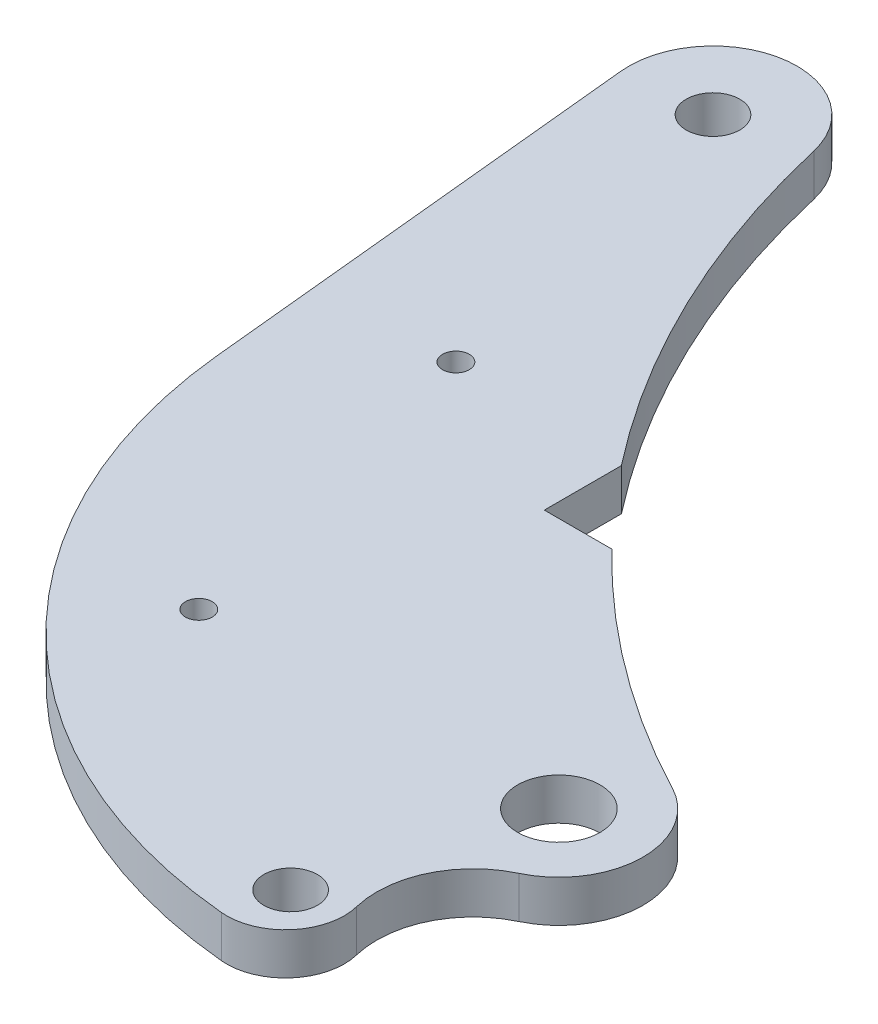
ISO-10303-21;
HEADER;
FILE_DESCRIPTION(('STEP AP214'),'2;1');
FILE_NAME('part.step','',(''),(''),'','','');
FILE_SCHEMA(('AUTOMOTIVE_DESIGN { 1 0 10303 214 1 1 1 1 }'));
ENDSEC;
DATA;
#1=APPLICATION_CONTEXT('core data for automotive mechanical design processes');
#2=APPLICATION_PROTOCOL_DEFINITION('international standard','automotive_design',2000,#1);
#3=PRODUCT_CONTEXT('',#1,'mechanical');
#4=PRODUCT('Part','Part','',(#3));
#5=PRODUCT_RELATED_PRODUCT_CATEGORY('part','',(#4));
#6=PRODUCT_DEFINITION_FORMATION('','',#4);
#7=PRODUCT_DEFINITION_CONTEXT('part definition',#1,'design');
#8=PRODUCT_DEFINITION('design','',#6,#7);
#9=PRODUCT_DEFINITION_SHAPE('','',#8);
#10=(LENGTH_UNIT() NAMED_UNIT(*) SI_UNIT(.MILLI.,.METRE.));
#11=(NAMED_UNIT(*) PLANE_ANGLE_UNIT() SI_UNIT($,.RADIAN.));
#12=(NAMED_UNIT(*) SI_UNIT($,.STERADIAN.) SOLID_ANGLE_UNIT());
#13=UNCERTAINTY_MEASURE_WITH_UNIT(LENGTH_MEASURE(1.E-05),#10,'distance_accuracy_value','');
#14=(GEOMETRIC_REPRESENTATION_CONTEXT(3) GLOBAL_UNCERTAINTY_ASSIGNED_CONTEXT((#13)) GLOBAL_UNIT_ASSIGNED_CONTEXT((#10,
#11,#12)) REPRESENTATION_CONTEXT('',''));
#15=CARTESIAN_POINT('',(0.,0.,0.));
#16=DIRECTION('',(0.,0.,1.));
#17=DIRECTION('',(1.,0.,0.));
#18=AXIS2_PLACEMENT_3D('',#15,#16,#17);
#19=CARTESIAN_POINT('',(0.,2.4765,0.));
#20=DIRECTION('',(0.,1.,0.));
#21=DIRECTION('',(0.,0.,1.));
#22=AXIS2_PLACEMENT_3D('',#19,#20,#21);
#23=PLANE('',#22);
#24=CARTESIAN_POINT('',(10.16,2.4765,40.64));
#25=DIRECTION('',(0.,1.,0.));
#26=DIRECTION('',(0.,0.,1.));
#27=AXIS2_PLACEMENT_3D('',#24,#25,#26);
#28=CIRCLE('',#27,1.5875);
#29=CARTESIAN_POINT('',(10.16,2.4765,42.2275));
#30=VERTEX_POINT('',#29);
#31=EDGE_CURVE('E234',#30,#30,#28,.T.);
#32=ORIENTED_EDGE('',*,*,#31,.F.);
#33=EDGE_LOOP('',(#32));
#34=FACE_BOUND('',#33,.T.);
#35=CARTESIAN_POINT('',(62.1230111231787,2.4765,80.394598630688));
#36=DIRECTION('',(0.,1.,0.));
#37=DIRECTION('',(0.,0.,1.));
#38=AXIS2_PLACEMENT_3D('',#35,#36,#37);
#39=CIRCLE('',#38,4.88950000000001);
#40=CARTESIAN_POINT('',(62.1230111231787,2.4765,85.2840986306881));
#41=VERTEX_POINT('',#40);
#42=EDGE_CURVE('E222',#41,#41,#39,.T.);
#43=ORIENTED_EDGE('',*,*,#42,.F.);
#44=EDGE_LOOP('',(#43));
#45=FACE_BOUND('',#44,.T.);
#46=CARTESIAN_POINT('',(0.,2.4765,0.));
#47=DIRECTION('',(0.,1.,0.));
#48=DIRECTION('',(0.,0.,1.));
#49=AXIS2_PLACEMENT_3D('',#46,#47,#48);
#50=CIRCLE('',#49,9.9695);
#51=CARTESIAN_POINT('',(9.71285470277228,2.4765,-2.24752836975072));
#52=VERTEX_POINT('',#51);
#53=CARTESIAN_POINT('',(-9.92069398107694,2.4765,0.985272136936646));
#54=VERTEX_POINT('',#53);
#55=EDGE_CURVE('E171',#52,#54,#50,.T.);
#56=ORIENTED_EDGE('',*,*,#55,.T.);
#57=DIRECTION('',(0.0988286410488635,0.,0.995104466731225));
#58=VECTOR('',#57,1.);
#59=CARTESIAN_POINT('',(-9.92069398107694,2.4765,0.985272136936646));
#60=LINE('',#59,#58);
#61=CARTESIAN_POINT('',(-4.64533862475767,2.4765,54.1027654359922));
#62=VERTEX_POINT('',#61);
#63=EDGE_CURVE('E109',#54,#62,#60,.T.);
#64=ORIENTED_EDGE('',*,*,#63,.T.);
#65=CARTESIAN_POINT('',(58.5437950126751,2.4765,47.8271467293893));
#66=DIRECTION('',(0.,1.,0.));
#67=DIRECTION('',(0.,0.,-1.));
#68=AXIS2_PLACEMENT_3D('',#65,#66,#67);
#69=CIRCLE('',#68,63.5);
#70=CARTESIAN_POINT('',(52.7819661923493,2.4765,111.06519958244));
#71=VERTEX_POINT('',#70);
#72=EDGE_CURVE('E192',#62,#71,#69,.T.);
#73=ORIENTED_EDGE('',*,*,#72,.T.);
#74=CARTESIAN_POINT('',(53.4157673625851,2.4765,104.109013768605));
#75=DIRECTION('',(0.,1.,0.));
#76=DIRECTION('',(0.,0.,1.));
#77=AXIS2_PLACEMENT_3D('',#74,#75,#76);
#78=CIRCLE('',#77,6.98499999999999);
#79=CARTESIAN_POINT('',(60.2000099379589,2.4765,102.446402064542));
#80=VERTEX_POINT('',#79);
#81=EDGE_CURVE('E211',#71,#80,#78,.T.);
#82=ORIENTED_EDGE('',*,*,#81,.T.);
#83=CARTESIAN_POINT('',(71.3014977885706,2.4765,99.7257647306217));
#84=DIRECTION('',(0.,-1.,0.));
#85=DIRECTION('',(0.,0.,-1.));
#86=AXIS2_PLACEMENT_3D('',#83,#84,#85);
#87=CIRCLE('',#86,11.43);
#88=CARTESIAN_POINT('',(66.3990420029013,2.4765,89.4005128078085));
#89=VERTEX_POINT('',#88);
#90=EDGE_CURVE('E208',#80,#89,#87,.T.);
#91=ORIENTED_EDGE('',*,*,#90,.T.);
#92=CARTESIAN_POINT('',(62.1230111231787,2.4765,80.394598630688));
#93=DIRECTION('',(0.,1.,0.));
#94=DIRECTION('',(0.,0.,1.));
#95=AXIS2_PLACEMENT_3D('',#92,#93,#94);
#96=CIRCLE('',#95,9.96950000000001);
#97=CARTESIAN_POINT('',(66.7480657496134,2.4765,71.5628490898272));
#98=VERTEX_POINT('',#97);
#99=EDGE_CURVE('E210',#89,#98,#96,.T.);
#100=ORIENTED_EDGE('',*,*,#99,.T.);
#101=CARTESIAN_POINT('',(118.595811880347,2.4765,-27.4427508586757));
#102=DIRECTION('',(0.,-1.,0.));
#103=DIRECTION('',(0.,0.,1.));
#104=AXIS2_PLACEMENT_3D('',#101,#102,#103);
#105=CIRCLE('',#104,111.76);
#106=CARTESIAN_POINT('',(38.6058108098868,2.4765,50.6078566261337));
#107=VERTEX_POINT('',#106);
#108=EDGE_CURVE('E134',#98,#107,#105,.T.);
#109=ORIENTED_EDGE('',*,*,#108,.T.);
#110=DIRECTION('',(-1.,0.,0.));
#111=VECTOR('',#110,1.);
#112=CARTESIAN_POINT('',(30.607,2.4765,50.6078566261337));
#113=LINE('',#112,#111);
#114=CARTESIAN_POINT('',(30.607,2.4765,50.6078566261337));
#115=VERTEX_POINT('',#114);
#116=EDGE_CURVE('E128',#107,#115,#113,.T.);
#117=ORIENTED_EDGE('',*,*,#116,.T.);
#118=DIRECTION('',(0.,0.,-1.));
#119=VECTOR('',#118,1.);
#120=CARTESIAN_POINT('',(30.607,2.4765,41.46491623204));
#121=LINE('',#120,#119);
#122=CARTESIAN_POINT('',(30.607,2.4765,41.46491623204));
#123=VERTEX_POINT('',#122);
#124=EDGE_CURVE('E132',#115,#123,#121,.T.);
#125=ORIENTED_EDGE('',*,*,#124,.T.);
#126=CARTESIAN_POINT('',(118.595811880347,2.4765,-27.4427508586757));
#127=DIRECTION('',(0.,-1.,0.));
#128=DIRECTION('',(0.,0.,1.));
#129=AXIS2_PLACEMENT_3D('',#126,#127,#128);
#130=CIRCLE('',#129,111.76);
#131=EDGE_CURVE('E60',#123,#52,#130,.T.);
#132=ORIENTED_EDGE('',*,*,#131,.T.);
#133=EDGE_LOOP('',(#56,#64,#73,#82,#91,#100,#109,#117,#125,#132));
#134=FACE_BOUND('',#133,.T.);
#135=CARTESIAN_POINT('',(0.,2.4765,0.));
#136=DIRECTION('',(0.,1.,0.));
#137=DIRECTION('',(0.,0.,1.));
#138=AXIS2_PLACEMENT_3D('',#135,#136,#137);
#139=CIRCLE('',#138,3.175);
#140=CARTESIAN_POINT('',(0.,2.4765,3.175));
#141=VERTEX_POINT('',#140);
#142=EDGE_CURVE('E156',#141,#141,#139,.T.);
#143=ORIENTED_EDGE('',*,*,#142,.F.);
#144=EDGE_LOOP('',(#143));
#145=FACE_BOUND('',#144,.T.);
#146=CARTESIAN_POINT('',(54.5672350025058,2.4765,104.644758366539));
#147=DIRECTION('',(0.,1.,0.));
#148=DIRECTION('',(0.,0.,1.));
#149=AXIS2_PLACEMENT_3D('',#146,#147,#148);
#150=CIRCLE('',#149,3.175);
#151=CARTESIAN_POINT('',(54.5672350025058,2.4765,107.819758366539));
#152=VERTEX_POINT('',#151);
#153=EDGE_CURVE('E228',#152,#152,#150,.T.);
#154=ORIENTED_EDGE('',*,*,#153,.F.);
#155=EDGE_LOOP('',(#154));
#156=FACE_BOUND('',#155,.T.);
#157=CARTESIAN_POINT('',(20.32,2.4765,81.28));
#158=DIRECTION('',(0.,1.,0.));
#159=DIRECTION('',(0.,0.,1.));
#160=AXIS2_PLACEMENT_3D('',#157,#158,#159);
#161=CIRCLE('',#160,1.58750000000001);
#162=CARTESIAN_POINT('',(20.32,2.4765,82.8675));
#163=VERTEX_POINT('',#162);
#164=EDGE_CURVE('E240',#163,#163,#161,.T.);
#165=ORIENTED_EDGE('',*,*,#164,.F.);
#166=EDGE_LOOP('',(#165));
#167=FACE_BOUND('',#166,.T.);
#168=ADVANCED_FACE('F43',(#34,#45,#134,#145,#156,#167),#23,.T.);
#169=CARTESIAN_POINT('',(0.,-2.4765,0.));
#170=DIRECTION('',(0.,1.,0.));
#171=DIRECTION('',(0.,0.,1.));
#172=AXIS2_PLACEMENT_3D('',#169,#170,#171);
#173=PLANE('',#172);
#174=CARTESIAN_POINT('',(0.,-2.4765,0.));
#175=DIRECTION('',(0.,1.,0.));
#176=DIRECTION('',(0.,0.,1.));
#177=AXIS2_PLACEMENT_3D('',#174,#175,#176);
#178=CIRCLE('',#177,9.9695);
#179=CARTESIAN_POINT('',(9.71285470277228,-2.4765,-2.24752836975072));
#180=VERTEX_POINT('',#179);
#181=CARTESIAN_POINT('',(-9.92069398107694,-2.4765,0.985272136936646));
#182=VERTEX_POINT('',#181);
#183=EDGE_CURVE('E152',#180,#182,#178,.T.);
#184=ORIENTED_EDGE('',*,*,#183,.F.);
#185=CARTESIAN_POINT('',(118.595811880347,-2.4765,-27.4427508586757));
#186=DIRECTION('',(0.,-1.,0.));
#187=DIRECTION('',(0.,0.,1.));
#188=AXIS2_PLACEMENT_3D('',#185,#186,#187);
#189=CIRCLE('',#188,111.76);
#190=CARTESIAN_POINT('',(30.607,-2.4765,41.46491623204));
#191=VERTEX_POINT('',#190);
#192=EDGE_CURVE('E101',#191,#180,#189,.T.);
#193=ORIENTED_EDGE('',*,*,#192,.F.);
#194=DIRECTION('',(0.,0.,-1.));
#195=VECTOR('',#194,1.);
#196=CARTESIAN_POINT('',(30.607,-2.4765,41.46491623204));
#197=LINE('',#196,#195);
#198=CARTESIAN_POINT('',(30.607,-2.4765,50.6078566261337));
#199=VERTEX_POINT('',#198);
#200=EDGE_CURVE('E95',#199,#191,#197,.T.);
#201=ORIENTED_EDGE('',*,*,#200,.F.);
#202=DIRECTION('',(-1.,0.,0.));
#203=VECTOR('',#202,1.);
#204=CARTESIAN_POINT('',(30.607,-2.4765,50.6078566261337));
#205=LINE('',#204,#203);
#206=CARTESIAN_POINT('',(38.6058108098868,-2.4765,50.6078566261337));
#207=VERTEX_POINT('',#206);
#208=EDGE_CURVE('E142',#207,#199,#205,.T.);
#209=ORIENTED_EDGE('',*,*,#208,.F.);
#210=CARTESIAN_POINT('',(118.595811880347,-2.4765,-27.4427508586757));
#211=DIRECTION('',(0.,-1.,0.));
#212=DIRECTION('',(0.,0.,1.));
#213=AXIS2_PLACEMENT_3D('',#210,#211,#212);
#214=CIRCLE('',#213,111.76);
#215=CARTESIAN_POINT('',(66.7480657496134,-2.4765,71.5628490898272));
#216=VERTEX_POINT('',#215);
#217=EDGE_CURVE('E166',#216,#207,#214,.T.);
#218=ORIENTED_EDGE('',*,*,#217,.F.);
#219=CARTESIAN_POINT('',(62.1230111231787,-2.4765,80.394598630688));
#220=DIRECTION('',(0.,1.,0.));
#221=DIRECTION('',(0.,0.,1.));
#222=AXIS2_PLACEMENT_3D('',#219,#220,#221);
#223=CIRCLE('',#222,9.96950000000001);
#224=CARTESIAN_POINT('',(66.3990420029013,-2.4765,89.4005128078085));
#225=VERTEX_POINT('',#224);
#226=EDGE_CURVE('E164',#225,#216,#223,.T.);
#227=ORIENTED_EDGE('',*,*,#226,.F.);
#228=CARTESIAN_POINT('',(71.3014977885706,-2.4765,99.7257647306217));
#229=DIRECTION('',(0.,-1.,0.));
#230=DIRECTION('',(0.,0.,-1.));
#231=AXIS2_PLACEMENT_3D('',#228,#229,#230);
#232=CIRCLE('',#231,11.43);
#233=CARTESIAN_POINT('',(60.2000099379589,-2.4765,102.446402064542));
#234=VERTEX_POINT('',#233);
#235=EDGE_CURVE('E162',#234,#225,#232,.T.);
#236=ORIENTED_EDGE('',*,*,#235,.F.);
#237=CARTESIAN_POINT('',(53.4157673625851,-2.4765,104.109013768605));
#238=DIRECTION('',(0.,1.,0.));
#239=DIRECTION('',(0.,0.,1.));
#240=AXIS2_PLACEMENT_3D('',#237,#238,#239);
#241=CIRCLE('',#240,6.98499999999999);
#242=CARTESIAN_POINT('',(52.7819661923493,-2.4765,111.06519958244));
#243=VERTEX_POINT('',#242);
#244=EDGE_CURVE('E160',#243,#234,#241,.T.);
#245=ORIENTED_EDGE('',*,*,#244,.F.);
#246=CARTESIAN_POINT('',(58.5437950126751,-2.4765,47.8271467293893));
#247=DIRECTION('',(0.,1.,0.));
#248=DIRECTION('',(0.,0.,-1.));
#249=AXIS2_PLACEMENT_3D('',#246,#247,#248);
#250=CIRCLE('',#249,63.5);
#251=CARTESIAN_POINT('',(-4.64533862475767,-2.4765,54.1027654359922));
#252=VERTEX_POINT('',#251);
#253=EDGE_CURVE('E158',#252,#243,#250,.T.);
#254=ORIENTED_EDGE('',*,*,#253,.F.);
#255=DIRECTION('',(0.0988286410488635,0.,0.995104466731225));
#256=VECTOR('',#255,1.);
#257=CARTESIAN_POINT('',(-9.92069398107694,-2.4765,0.985272136936646));
#258=LINE('',#257,#256);
#259=EDGE_CURVE('E155',#182,#252,#258,.T.);
#260=ORIENTED_EDGE('',*,*,#259,.F.);
#261=EDGE_LOOP('',(#184,#193,#201,#209,#218,#227,#236,#245,#254,#260));
#262=FACE_BOUND('',#261,.T.);
#263=CARTESIAN_POINT('',(0.,-2.4765,0.));
#264=DIRECTION('',(0.,1.,0.));
#265=DIRECTION('',(0.,0.,1.));
#266=AXIS2_PLACEMENT_3D('',#263,#264,#265);
#267=CIRCLE('',#266,3.175);
#268=CARTESIAN_POINT('',(0.,-2.4765,3.175));
#269=VERTEX_POINT('',#268);
#270=EDGE_CURVE('E219',#269,#269,#267,.T.);
#271=ORIENTED_EDGE('',*,*,#270,.T.);
#272=EDGE_LOOP('',(#271));
#273=FACE_BOUND('',#272,.T.);
#274=CARTESIAN_POINT('',(62.1230111231787,-2.4765,80.394598630688));
#275=DIRECTION('',(0.,1.,0.));
#276=DIRECTION('',(0.,0.,1.));
#277=AXIS2_PLACEMENT_3D('',#274,#275,#276);
#278=CIRCLE('',#277,4.88950000000001);
#279=CARTESIAN_POINT('',(62.1230111231787,-2.4765,85.2840986306881));
#280=VERTEX_POINT('',#279);
#281=EDGE_CURVE('E225',#280,#280,#278,.T.);
#282=ORIENTED_EDGE('',*,*,#281,.T.);
#283=EDGE_LOOP('',(#282));
#284=FACE_BOUND('',#283,.T.);
#285=CARTESIAN_POINT('',(54.5672350025058,-2.4765,104.644758366539));
#286=DIRECTION('',(0.,1.,0.));
#287=DIRECTION('',(0.,0.,1.));
#288=AXIS2_PLACEMENT_3D('',#285,#286,#287);
#289=CIRCLE('',#288,3.175);
#290=CARTESIAN_POINT('',(54.5672350025058,-2.4765,107.819758366539));
#291=VERTEX_POINT('',#290);
#292=EDGE_CURVE('E231',#291,#291,#289,.T.);
#293=ORIENTED_EDGE('',*,*,#292,.T.);
#294=EDGE_LOOP('',(#293));
#295=FACE_BOUND('',#294,.T.);
#296=CARTESIAN_POINT('',(10.16,-2.4765,40.64));
#297=DIRECTION('',(0.,1.,0.));
#298=DIRECTION('',(0.,0.,1.));
#299=AXIS2_PLACEMENT_3D('',#296,#297,#298);
#300=CIRCLE('',#299,1.5875);
#301=CARTESIAN_POINT('',(10.16,-2.4765,42.2275));
#302=VERTEX_POINT('',#301);
#303=EDGE_CURVE('E237',#302,#302,#300,.T.);
#304=ORIENTED_EDGE('',*,*,#303,.T.);
#305=EDGE_LOOP('',(#304));
#306=FACE_BOUND('',#305,.T.);
#307=CARTESIAN_POINT('',(20.32,-2.4765,81.28));
#308=DIRECTION('',(0.,1.,0.));
#309=DIRECTION('',(0.,0.,1.));
#310=AXIS2_PLACEMENT_3D('',#307,#308,#309);
#311=CIRCLE('',#310,1.58750000000001);
#312=CARTESIAN_POINT('',(20.32,-2.4765,82.8675));
#313=VERTEX_POINT('',#312);
#314=EDGE_CURVE('E243',#313,#313,#311,.T.);
#315=ORIENTED_EDGE('',*,*,#314,.T.);
#316=EDGE_LOOP('',(#315));
#317=FACE_BOUND('',#316,.T.);
#318=ADVANCED_FACE('F196',(#262,#273,#284,#295,#306,#317),#173,.F.);
#319=CARTESIAN_POINT('',(0.,2.4765,0.));
#320=DIRECTION('',(0.,-1.,0.));
#321=DIRECTION('',(0.,0.,-1.));
#322=AXIS2_PLACEMENT_3D('',#319,#320,#321);
#323=CYLINDRICAL_SURFACE('',#322,9.9695);
#324=ORIENTED_EDGE('',*,*,#183,.T.);
#325=DIRECTION('',(0.,-1.,0.));
#326=VECTOR('',#325,1.);
#327=CARTESIAN_POINT('',(-9.92069398107694,2.4765,0.985272136936646));
#328=LINE('',#327,#326);
#329=EDGE_CURVE('E13',#54,#182,#328,.T.);
#330=ORIENTED_EDGE('',*,*,#329,.F.);
#331=ORIENTED_EDGE('',*,*,#55,.F.);
#332=DIRECTION('',(0.,-1.,0.));
#333=VECTOR('',#332,1.);
#334=CARTESIAN_POINT('',(9.71285470277228,2.4765,-2.24752836975072));
#335=LINE('',#334,#333);
#336=EDGE_CURVE('E148',#52,#180,#335,.T.);
#337=ORIENTED_EDGE('',*,*,#336,.T.);
#338=EDGE_LOOP('',(#324,#330,#331,#337));
#339=FACE_BOUND('',#338,.T.);
#340=ADVANCED_FACE('F45',(#339),#323,.T.);
#341=CARTESIAN_POINT('',(-9.92069398107694,2.4765,0.985272136936646));
#342=DIRECTION('',(0.995104466731225,0.,-0.0988286410488635));
#343=DIRECTION('',(-0.0988286410488635,0.,-0.995104466731225));
#344=AXIS2_PLACEMENT_3D('',#341,#342,#343);
#345=PLANE('',#344);
#346=ORIENTED_EDGE('',*,*,#259,.T.);
#347=DIRECTION('',(0.,-1.,0.));
#348=VECTOR('',#347,1.);
#349=CARTESIAN_POINT('',(-4.64533862475767,2.4765,54.1027654359922));
#350=LINE('',#349,#348);
#351=EDGE_CURVE('E52',#62,#252,#350,.T.);
#352=ORIENTED_EDGE('',*,*,#351,.F.);
#353=ORIENTED_EDGE('',*,*,#63,.F.);
#354=ORIENTED_EDGE('',*,*,#329,.T.);
#355=EDGE_LOOP('',(#346,#352,#353,#354));
#356=FACE_BOUND('',#355,.T.);
#357=ADVANCED_FACE('F285',(#356),#345,.F.);
#358=CARTESIAN_POINT('',(58.5437950126751,2.4765,47.8271467293893));
#359=DIRECTION('',(0.,-1.,0.));
#360=DIRECTION('',(0.,0.,-1.));
#361=AXIS2_PLACEMENT_3D('',#358,#359,#360);
#362=CYLINDRICAL_SURFACE('',#361,63.5);
#363=ORIENTED_EDGE('',*,*,#253,.T.);
#364=DIRECTION('',(0.,-1.,0.));
#365=VECTOR('',#364,1.);
#366=CARTESIAN_POINT('',(52.7819661923493,2.4765,111.06519958244));
#367=LINE('',#366,#365);
#368=EDGE_CURVE('E184',#71,#243,#367,.T.);
#369=ORIENTED_EDGE('',*,*,#368,.F.);
#370=ORIENTED_EDGE('',*,*,#72,.F.);
#371=ORIENTED_EDGE('',*,*,#351,.T.);
#372=EDGE_LOOP('',(#363,#369,#370,#371));
#373=FACE_BOUND('',#372,.T.);
#374=ADVANCED_FACE('F190',(#373),#362,.T.);
#375=CARTESIAN_POINT('',(53.4157673625851,2.4765,104.109013768605));
#376=DIRECTION('',(0.,-1.,0.));
#377=DIRECTION('',(0.,0.,-1.));
#378=AXIS2_PLACEMENT_3D('',#375,#376,#377);
#379=CYLINDRICAL_SURFACE('',#378,6.98499999999999);
#380=ORIENTED_EDGE('',*,*,#244,.T.);
#381=DIRECTION('',(0.,-1.,0.));
#382=VECTOR('',#381,1.);
#383=CARTESIAN_POINT('',(60.2000099379589,2.4765,102.446402064542));
#384=LINE('',#383,#382);
#385=EDGE_CURVE('E181',#80,#234,#384,.T.);
#386=ORIENTED_EDGE('',*,*,#385,.F.);
#387=ORIENTED_EDGE('',*,*,#81,.F.);
#388=ORIENTED_EDGE('',*,*,#368,.T.);
#389=EDGE_LOOP('',(#380,#386,#387,#388));
#390=FACE_BOUND('',#389,.T.);
#391=ADVANCED_FACE('F202',(#390),#379,.T.);
#392=CARTESIAN_POINT('',(71.3014977885706,2.4765,99.7257647306217));
#393=DIRECTION('',(0.,-1.,0.));
#394=DIRECTION('',(0.,0.,-1.));
#395=AXIS2_PLACEMENT_3D('',#392,#393,#394);
#396=CYLINDRICAL_SURFACE('',#395,11.43);
#397=ORIENTED_EDGE('',*,*,#235,.T.);
#398=DIRECTION('',(0.,-1.,0.));
#399=VECTOR('',#398,1.);
#400=CARTESIAN_POINT('',(66.3990420029013,2.4765,89.4005128078085));
#401=LINE('',#400,#399);
#402=EDGE_CURVE('E178',#89,#225,#401,.T.);
#403=ORIENTED_EDGE('',*,*,#402,.F.);
#404=ORIENTED_EDGE('',*,*,#90,.F.);
#405=ORIENTED_EDGE('',*,*,#385,.T.);
#406=EDGE_LOOP('',(#397,#403,#404,#405));
#407=FACE_BOUND('',#406,.T.);
#408=ADVANCED_FACE('F206',(#407),#396,.F.);
#409=CARTESIAN_POINT('',(62.1230111231787,2.4765,80.394598630688));
#410=DIRECTION('',(0.,-1.,0.));
#411=DIRECTION('',(0.,0.,-1.));
#412=AXIS2_PLACEMENT_3D('',#409,#410,#411);
#413=CYLINDRICAL_SURFACE('',#412,9.96950000000001);
#414=ORIENTED_EDGE('',*,*,#226,.T.);
#415=DIRECTION('',(0.,-1.,0.));
#416=VECTOR('',#415,1.);
#417=CARTESIAN_POINT('',(66.7480657496134,2.4765,71.5628490898272));
#418=LINE('',#417,#416);
#419=EDGE_CURVE('E175',#98,#216,#418,.T.);
#420=ORIENTED_EDGE('',*,*,#419,.F.);
#421=ORIENTED_EDGE('',*,*,#99,.F.);
#422=ORIENTED_EDGE('',*,*,#402,.T.);
#423=EDGE_LOOP('',(#414,#420,#421,#422));
#424=FACE_BOUND('',#423,.T.);
#425=ADVANCED_FACE('F275',(#424),#413,.T.);
#426=CARTESIAN_POINT('',(118.595811880347,2.4765,-27.4427508586757));
#427=DIRECTION('',(0.,-1.,0.));
#428=DIRECTION('',(0.,0.,-1.));
#429=AXIS2_PLACEMENT_3D('',#426,#427,#428);
#430=CYLINDRICAL_SURFACE('',#429,111.76);
#431=ORIENTED_EDGE('',*,*,#217,.T.);
#432=DIRECTION('',(0.,-1.,0.));
#433=VECTOR('',#432,1.);
#434=CARTESIAN_POINT('',(38.6058108098868,2.4765,50.6078566261337));
#435=LINE('',#434,#433);
#436=EDGE_CURVE('E143',#107,#207,#435,.T.);
#437=ORIENTED_EDGE('',*,*,#436,.F.);
#438=ORIENTED_EDGE('',*,*,#108,.F.);
#439=ORIENTED_EDGE('',*,*,#419,.T.);
#440=EDGE_LOOP('',(#431,#437,#438,#439));
#441=FACE_BOUND('',#440,.T.);
#442=ADVANCED_FACE('F272',(#441),#430,.F.);
#443=CARTESIAN_POINT('',(30.607,2.4765,50.6078566261337));
#444=DIRECTION('',(0.,0.,1.));
#445=DIRECTION('',(1.,0.,0.));
#446=AXIS2_PLACEMENT_3D('',#443,#444,#445);
#447=PLANE('',#446);
#448=ORIENTED_EDGE('',*,*,#208,.T.);
#449=DIRECTION('',(0.,-1.,0.));
#450=VECTOR('',#449,1.);
#451=CARTESIAN_POINT('',(30.607,2.4765,50.6078566261337));
#452=LINE('',#451,#450);
#453=EDGE_CURVE('E139',#115,#199,#452,.T.);
#454=ORIENTED_EDGE('',*,*,#453,.F.);
#455=ORIENTED_EDGE('',*,*,#116,.F.);
#456=ORIENTED_EDGE('',*,*,#436,.T.);
#457=EDGE_LOOP('',(#448,#454,#455,#456));
#458=FACE_BOUND('',#457,.T.);
#459=ADVANCED_FACE('F140',(#458),#447,.F.);
#460=CARTESIAN_POINT('',(30.607,2.4765,41.46491623204));
#461=DIRECTION('',(-1.,0.,0.));
#462=DIRECTION('',(0.,0.,1.));
#463=AXIS2_PLACEMENT_3D('',#460,#461,#462);
#464=PLANE('',#463);
#465=ORIENTED_EDGE('',*,*,#200,.T.);
#466=DIRECTION('',(0.,-1.,0.));
#467=VECTOR('',#466,1.);
#468=CARTESIAN_POINT('',(30.607,2.4765,41.46491623204));
#469=LINE('',#468,#467);
#470=EDGE_CURVE('E144',#123,#191,#469,.T.);
#471=ORIENTED_EDGE('',*,*,#470,.F.);
#472=ORIENTED_EDGE('',*,*,#124,.F.);
#473=ORIENTED_EDGE('',*,*,#453,.T.);
#474=EDGE_LOOP('',(#465,#471,#472,#473));
#475=FACE_BOUND('',#474,.T.);
#476=ADVANCED_FACE('F146',(#475),#464,.F.);
#477=CARTESIAN_POINT('',(118.595811880347,2.4765,-27.4427508586757));
#478=DIRECTION('',(0.,-1.,0.));
#479=DIRECTION('',(0.,0.,-1.));
#480=AXIS2_PLACEMENT_3D('',#477,#478,#479);
#481=CYLINDRICAL_SURFACE('',#480,111.76);
#482=ORIENTED_EDGE('',*,*,#192,.T.);
#483=ORIENTED_EDGE('',*,*,#336,.F.);
#484=ORIENTED_EDGE('',*,*,#131,.F.);
#485=ORIENTED_EDGE('',*,*,#470,.T.);
#486=EDGE_LOOP('',(#482,#483,#484,#485));
#487=FACE_BOUND('',#486,.T.);
#488=ADVANCED_FACE('F265',(#487),#481,.F.);
#489=CARTESIAN_POINT('',(0.,2.4765,0.));
#490=DIRECTION('',(0.,-1.,0.));
#491=DIRECTION('',(0.,0.,-1.));
#492=AXIS2_PLACEMENT_3D('',#489,#490,#491);
#493=CYLINDRICAL_SURFACE('',#492,3.175);
#494=ORIENTED_EDGE('',*,*,#142,.T.);
#495=EDGE_LOOP('',(#494));
#496=FACE_BOUND('',#495,.T.);
#497=ORIENTED_EDGE('',*,*,#270,.F.);
#498=EDGE_LOOP('',(#497));
#499=FACE_BOUND('',#498,.T.);
#500=ADVANCED_FACE('F262',(#496,#499),#493,.F.);
#501=CARTESIAN_POINT('',(62.1230111231787,2.4765,80.394598630688));
#502=DIRECTION('',(0.,-1.,0.));
#503=DIRECTION('',(0.,0.,-1.));
#504=AXIS2_PLACEMENT_3D('',#501,#502,#503);
#505=CYLINDRICAL_SURFACE('',#504,4.88950000000001);
#506=ORIENTED_EDGE('',*,*,#42,.T.);
#507=EDGE_LOOP('',(#506));
#508=FACE_BOUND('',#507,.T.);
#509=ORIENTED_EDGE('',*,*,#281,.F.);
#510=EDGE_LOOP('',(#509));
#511=FACE_BOUND('',#510,.T.);
#512=ADVANCED_FACE('F361',(#508,#511),#505,.F.);
#513=CARTESIAN_POINT('',(54.5672350025058,2.4765,104.644758366539));
#514=DIRECTION('',(0.,-1.,0.));
#515=DIRECTION('',(0.,0.,-1.));
#516=AXIS2_PLACEMENT_3D('',#513,#514,#515);
#517=CYLINDRICAL_SURFACE('',#516,3.175);
#518=ORIENTED_EDGE('',*,*,#153,.T.);
#519=EDGE_LOOP('',(#518));
#520=FACE_BOUND('',#519,.T.);
#521=ORIENTED_EDGE('',*,*,#292,.F.);
#522=EDGE_LOOP('',(#521));
#523=FACE_BOUND('',#522,.T.);
#524=ADVANCED_FACE('F369',(#520,#523),#517,.F.);
#525=CARTESIAN_POINT('',(10.16,2.4765,40.64));
#526=DIRECTION('',(0.,-1.,0.));
#527=DIRECTION('',(0.,0.,-1.));
#528=AXIS2_PLACEMENT_3D('',#525,#526,#527);
#529=CYLINDRICAL_SURFACE('',#528,1.5875);
#530=ORIENTED_EDGE('',*,*,#31,.T.);
#531=EDGE_LOOP('',(#530));
#532=FACE_BOUND('',#531,.T.);
#533=ORIENTED_EDGE('',*,*,#303,.F.);
#534=EDGE_LOOP('',(#533));
#535=FACE_BOUND('',#534,.T.);
#536=ADVANCED_FACE('F377',(#532,#535),#529,.F.);
#537=CARTESIAN_POINT('',(20.32,2.4765,81.28));
#538=DIRECTION('',(0.,-1.,0.));
#539=DIRECTION('',(0.,0.,-1.));
#540=AXIS2_PLACEMENT_3D('',#537,#538,#539);
#541=CYLINDRICAL_SURFACE('',#540,1.58750000000001);
#542=ORIENTED_EDGE('',*,*,#164,.T.);
#543=EDGE_LOOP('',(#542));
#544=FACE_BOUND('',#543,.T.);
#545=ORIENTED_EDGE('',*,*,#314,.F.);
#546=EDGE_LOOP('',(#545));
#547=FACE_BOUND('',#546,.T.);
#548=ADVANCED_FACE('F249',(#544,#547),#541,.F.);
#549=CLOSED_SHELL('',(#168,#318,#340,#357,#374,#391,#408,#425,#442,#459,#476,#488,#500,#512,
#524,#536,#548));
#550=MANIFOLD_SOLID_BREP('B2',#549);
#551=ADVANCED_BREP_SHAPE_REPRESENTATION('',(#18,#550),#14);
#552=SHAPE_DEFINITION_REPRESENTATION(#9,#551);
ENDSEC;
END-ISO-10303-21;
